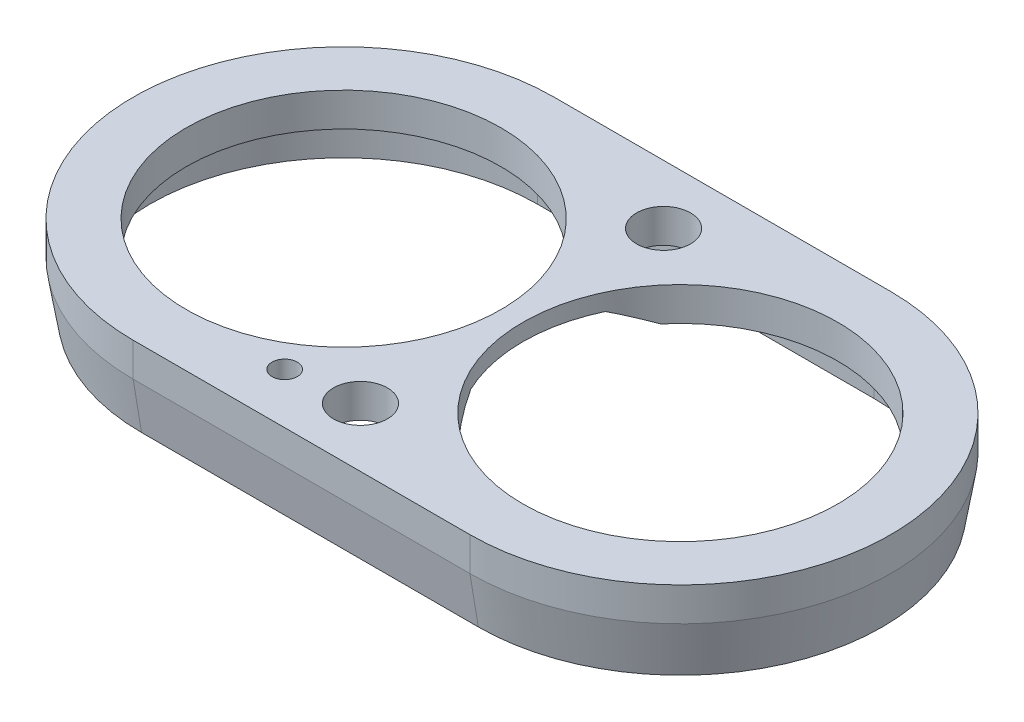
ISO-10303-21;
HEADER;
FILE_DESCRIPTION(('STEP AP214'),'2;1');
FILE_NAME('part.step','',(''),(''),'','','');
FILE_SCHEMA(('AUTOMOTIVE_DESIGN { 1 0 10303 214 1 1 1 1 }'));
ENDSEC;
DATA;
#1=APPLICATION_CONTEXT('core data for automotive mechanical design processes');
#2=APPLICATION_PROTOCOL_DEFINITION('international standard','automotive_design',2000,#1);
#3=PRODUCT_CONTEXT('',#1,'mechanical');
#4=PRODUCT('Part','Part','',(#3));
#5=PRODUCT_RELATED_PRODUCT_CATEGORY('part','',(#4));
#6=PRODUCT_DEFINITION_FORMATION('','',#4);
#7=PRODUCT_DEFINITION_CONTEXT('part definition',#1,'design');
#8=PRODUCT_DEFINITION('design','',#6,#7);
#9=PRODUCT_DEFINITION_SHAPE('','',#8);
#10=(LENGTH_UNIT() NAMED_UNIT(*) SI_UNIT(.MILLI.,.METRE.));
#11=(NAMED_UNIT(*) PLANE_ANGLE_UNIT() SI_UNIT($,.RADIAN.));
#12=(NAMED_UNIT(*) SI_UNIT($,.STERADIAN.) SOLID_ANGLE_UNIT());
#13=UNCERTAINTY_MEASURE_WITH_UNIT(LENGTH_MEASURE(1.E-05),#10,'distance_accuracy_value','');
#14=(GEOMETRIC_REPRESENTATION_CONTEXT(3) GLOBAL_UNCERTAINTY_ASSIGNED_CONTEXT((#13)) GLOBAL_UNIT_ASSIGNED_CONTEXT((#10,
#11,#12)) REPRESENTATION_CONTEXT('',''));
#15=CARTESIAN_POINT('',(0.,0.,0.));
#16=DIRECTION('',(0.,0.,1.));
#17=DIRECTION('',(1.,0.,0.));
#18=AXIS2_PLACEMENT_3D('',#15,#16,#17);
#19=CARTESIAN_POINT('',(10.,2.,0.));
#20=DIRECTION('',(0.,-1.,0.));
#21=DIRECTION('',(0.,0.,-1.));
#22=AXIS2_PLACEMENT_3D('',#19,#20,#21);
#23=CYLINDRICAL_SURFACE('',#22,12.5);
#24=DIRECTION('',(0.,-1.,0.));
#25=VECTOR('',#24,1.);
#26=CARTESIAN_POINT('',(10.,2.,12.5));
#27=LINE('',#26,#25);
#28=CARTESIAN_POINT('',(10.,2.,12.5));
#29=VERTEX_POINT('',#28);
#30=CARTESIAN_POINT('',(10.,0.,12.5));
#31=VERTEX_POINT('',#30);
#32=EDGE_CURVE('E305',#29,#31,#27,.T.);
#33=ORIENTED_EDGE('',*,*,#32,.T.);
#34=CARTESIAN_POINT('',(10.,0.,0.));
#35=DIRECTION('',(0.,-1.,0.));
#36=DIRECTION('',(0.,0.,-1.));
#37=AXIS2_PLACEMENT_3D('',#34,#35,#36);
#38=CIRCLE('',#37,12.5);
#39=CARTESIAN_POINT('',(10.,0.,-12.5));
#40=VERTEX_POINT('',#39);
#41=EDGE_CURVE('E325',#31,#40,#38,.F.);
#42=ORIENTED_EDGE('',*,*,#41,.T.);
#43=DIRECTION('',(0.,-1.,0.));
#44=VECTOR('',#43,1.);
#45=CARTESIAN_POINT('',(10.,2.,-12.5));
#46=LINE('',#45,#44);
#47=CARTESIAN_POINT('',(10.,2.,-12.5));
#48=VERTEX_POINT('',#47);
#49=EDGE_CURVE('E313',#48,#40,#46,.T.);
#50=ORIENTED_EDGE('',*,*,#49,.F.);
#51=CARTESIAN_POINT('',(10.,2.,0.));
#52=DIRECTION('',(0.,1.,0.));
#53=DIRECTION('',(0.,0.,1.));
#54=AXIS2_PLACEMENT_3D('',#51,#52,#53);
#55=CIRCLE('',#54,12.5);
#56=EDGE_CURVE('E158',#48,#29,#55,.F.);
#57=ORIENTED_EDGE('',*,*,#56,.T.);
#58=EDGE_LOOP('',(#33,#42,#50,#57));
#59=FACE_BOUND('',#58,.T.);
#60=ADVANCED_FACE('F38',(#59),#23,.T.);
#61=CARTESIAN_POINT('',(0.,2.,-12.5));
#62=DIRECTION('',(0.,0.,1.));
#63=DIRECTION('',(1.,0.,0.));
#64=AXIS2_PLACEMENT_3D('',#61,#62,#63);
#65=PLANE('',#64);
#66=ORIENTED_EDGE('',*,*,#49,.T.);
#67=DIRECTION('',(-1.,0.,0.));
#68=VECTOR('',#67,1.);
#69=CARTESIAN_POINT('',(-10.,0.,-12.5));
#70=LINE('',#69,#68);
#71=CARTESIAN_POINT('',(-10.,0.,-12.5));
#72=VERTEX_POINT('',#71);
#73=EDGE_CURVE('E328',#40,#72,#70,.T.);
#74=ORIENTED_EDGE('',*,*,#73,.T.);
#75=DIRECTION('',(0.,-1.,0.));
#76=VECTOR('',#75,1.);
#77=CARTESIAN_POINT('',(-10.,2.,-12.5));
#78=LINE('',#77,#76);
#79=CARTESIAN_POINT('',(-10.,2.,-12.5));
#80=VERTEX_POINT('',#79);
#81=EDGE_CURVE('E310',#80,#72,#78,.T.);
#82=ORIENTED_EDGE('',*,*,#81,.F.);
#83=DIRECTION('',(-1.,0.,0.));
#84=VECTOR('',#83,1.);
#85=CARTESIAN_POINT('',(0.,2.,-12.5));
#86=LINE('',#85,#84);
#87=EDGE_CURVE('E298',#48,#80,#86,.T.);
#88=ORIENTED_EDGE('',*,*,#87,.F.);
#89=EDGE_LOOP('',(#66,#74,#82,#88));
#90=FACE_BOUND('',#89,.T.);
#91=ADVANCED_FACE('F199',(#90),#65,.F.);
#92=CARTESIAN_POINT('',(-10.,2.,0.));
#93=DIRECTION('',(0.,-1.,0.));
#94=DIRECTION('',(0.,0.,-1.));
#95=AXIS2_PLACEMENT_3D('',#92,#93,#94);
#96=CYLINDRICAL_SURFACE('',#95,12.5);
#97=ORIENTED_EDGE('',*,*,#81,.T.);
#98=CARTESIAN_POINT('',(-10.,0.,0.));
#99=DIRECTION('',(0.,-1.,0.));
#100=DIRECTION('',(0.,0.,-1.));
#101=AXIS2_PLACEMENT_3D('',#98,#99,#100);
#102=CIRCLE('',#101,12.5);
#103=CARTESIAN_POINT('',(-10.,0.,12.5));
#104=VERTEX_POINT('',#103);
#105=EDGE_CURVE('E168',#72,#104,#102,.F.);
#106=ORIENTED_EDGE('',*,*,#105,.T.);
#107=DIRECTION('',(0.,-1.,0.));
#108=VECTOR('',#107,1.);
#109=CARTESIAN_POINT('',(-10.,2.,12.5));
#110=LINE('',#109,#108);
#111=CARTESIAN_POINT('',(-10.,2.,12.5));
#112=VERTEX_POINT('',#111);
#113=EDGE_CURVE('E307',#112,#104,#110,.T.);
#114=ORIENTED_EDGE('',*,*,#113,.F.);
#115=CARTESIAN_POINT('',(-10.,2.,0.));
#116=DIRECTION('',(0.,1.,0.));
#117=DIRECTION('',(0.,0.,1.));
#118=AXIS2_PLACEMENT_3D('',#115,#116,#117);
#119=CIRCLE('',#118,12.5);
#120=EDGE_CURVE('E300',#80,#112,#119,.T.);
#121=ORIENTED_EDGE('',*,*,#120,.F.);
#122=EDGE_LOOP('',(#97,#106,#114,#121));
#123=FACE_BOUND('',#122,.T.);
#124=ADVANCED_FACE('F205',(#123),#96,.T.);
#125=CARTESIAN_POINT('',(0.,2.,12.5));
#126=DIRECTION('',(0.,0.,1.));
#127=DIRECTION('',(1.,0.,0.));
#128=AXIS2_PLACEMENT_3D('',#125,#126,#127);
#129=PLANE('',#128);
#130=ORIENTED_EDGE('',*,*,#113,.T.);
#131=DIRECTION('',(1.,0.,0.));
#132=VECTOR('',#131,1.);
#133=CARTESIAN_POINT('',(0.,0.,12.5));
#134=LINE('',#133,#132);
#135=EDGE_CURVE('E330',#104,#31,#134,.T.);
#136=ORIENTED_EDGE('',*,*,#135,.T.);
#137=ORIENTED_EDGE('',*,*,#32,.F.);
#138=DIRECTION('',(-1.,0.,0.));
#139=VECTOR('',#138,1.);
#140=CARTESIAN_POINT('',(0.,2.,12.5));
#141=LINE('',#140,#139);
#142=EDGE_CURVE('E302',#29,#112,#141,.T.);
#143=ORIENTED_EDGE('',*,*,#142,.T.);
#144=EDGE_LOOP('',(#130,#136,#137,#143));
#145=FACE_BOUND('',#144,.T.);
#146=ADVANCED_FACE('F350',(#145),#129,.T.);
#147=CARTESIAN_POINT('',(0.,2.,0.));
#148=DIRECTION('',(0.,1.,0.));
#149=DIRECTION('',(0.,0.,1.));
#150=AXIS2_PLACEMENT_3D('',#147,#148,#149);
#151=PLANE('',#150);
#152=CARTESIAN_POINT('',(-4.,2.,9.5));
#153=DIRECTION('',(0.,1.,0.));
#154=DIRECTION('',(0.,0.,1.));
#155=AXIS2_PLACEMENT_3D('',#152,#153,#154);
#156=CIRCLE('',#155,0.75);
#157=CARTESIAN_POINT('',(-4.,2.,10.25));
#158=VERTEX_POINT('',#157);
#159=EDGE_CURVE('E178',#158,#158,#156,.T.);
#160=ORIENTED_EDGE('',*,*,#159,.F.);
#161=EDGE_LOOP('',(#160));
#162=FACE_BOUND('',#161,.T.);
#163=CARTESIAN_POINT('',(0.,2.,9.));
#164=DIRECTION('',(0.,1.,0.));
#165=DIRECTION('',(0.,0.,1.));
#166=AXIS2_PLACEMENT_3D('',#163,#164,#165);
#167=CIRCLE('',#166,1.6);
#168=CARTESIAN_POINT('',(0.,2.,10.6));
#169=VERTEX_POINT('',#168);
#170=EDGE_CURVE('E583',#169,#169,#167,.T.);
#171=ORIENTED_EDGE('',*,*,#170,.F.);
#172=EDGE_LOOP('',(#171));
#173=FACE_BOUND('',#172,.T.);
#174=CARTESIAN_POINT('',(0.,2.,-9.));
#175=DIRECTION('',(0.,1.,0.));
#176=DIRECTION('',(0.,0.,1.));
#177=AXIS2_PLACEMENT_3D('',#174,#175,#176);
#178=CIRCLE('',#177,1.6);
#179=CARTESIAN_POINT('',(0.,2.,-7.4));
#180=VERTEX_POINT('',#179);
#181=EDGE_CURVE('E579',#180,#180,#178,.T.);
#182=ORIENTED_EDGE('',*,*,#181,.F.);
#183=EDGE_LOOP('',(#182));
#184=FACE_BOUND('',#183,.T.);
#185=CARTESIAN_POINT('',(10.,2.,0.));
#186=DIRECTION('',(0.,1.,0.));
#187=DIRECTION('',(0.,0.,1.));
#188=AXIS2_PLACEMENT_3D('',#185,#186,#187);
#189=CIRCLE('',#188,9.35);
#190=CARTESIAN_POINT('',(10.,2.,9.35));
#191=VERTEX_POINT('',#190);
#192=EDGE_CURVE('E159',#191,#191,#189,.T.);
#193=ORIENTED_EDGE('',*,*,#192,.F.);
#194=EDGE_LOOP('',(#193));
#195=FACE_BOUND('',#194,.T.);
#196=CARTESIAN_POINT('',(-10.,2.,0.));
#197=DIRECTION('',(0.,1.,0.));
#198=DIRECTION('',(0.,0.,-1.));
#199=AXIS2_PLACEMENT_3D('',#196,#197,#198);
#200=CIRCLE('',#199,9.35);
#201=CARTESIAN_POINT('',(-10.,2.,-9.35));
#202=VERTEX_POINT('',#201);
#203=EDGE_CURVE('E292',#202,#202,#200,.T.);
#204=ORIENTED_EDGE('',*,*,#203,.F.);
#205=EDGE_LOOP('',(#204));
#206=FACE_BOUND('',#205,.T.);
#207=ORIENTED_EDGE('',*,*,#56,.F.);
#208=ORIENTED_EDGE('',*,*,#87,.T.);
#209=ORIENTED_EDGE('',*,*,#120,.T.);
#210=ORIENTED_EDGE('',*,*,#142,.F.);
#211=EDGE_LOOP('',(#207,#208,#209,#210));
#212=FACE_BOUND('',#211,.T.);
#213=ADVANCED_FACE('F354',(#162,#173,#184,#195,#206,#212),#151,.T.);
#214=CARTESIAN_POINT('',(0.,0.,0.));
#215=DIRECTION('',(0.,1.,0.));
#216=DIRECTION('',(0.,0.,1.));
#217=AXIS2_PLACEMENT_3D('',#214,#215,#216);
#218=PLANE('',#217);
#219=CARTESIAN_POINT('',(-4.,0.,9.5));
#220=DIRECTION('',(0.,1.,0.));
#221=DIRECTION('',(0.,0.,1.));
#222=AXIS2_PLACEMENT_3D('',#219,#220,#221);
#223=CIRCLE('',#222,0.75);
#224=CARTESIAN_POINT('',(-4.,0.,10.25));
#225=VERTEX_POINT('',#224);
#226=EDGE_CURVE('E43',#225,#225,#223,.T.);
#227=ORIENTED_EDGE('',*,*,#226,.T.);
#228=EDGE_LOOP('',(#227));
#229=FACE_BOUND('',#228,.T.);
#230=CARTESIAN_POINT('',(0.,0.,9.));
#231=DIRECTION('',(0.,1.,0.));
#232=DIRECTION('',(0.,0.,1.));
#233=AXIS2_PLACEMENT_3D('',#230,#231,#232);
#234=CIRCLE('',#233,1.6);
#235=CARTESIAN_POINT('',(0.,0.,10.6));
#236=VERTEX_POINT('',#235);
#237=EDGE_CURVE('E177',#236,#236,#234,.T.);
#238=ORIENTED_EDGE('',*,*,#237,.T.);
#239=EDGE_LOOP('',(#238));
#240=FACE_BOUND('',#239,.T.);
#241=CARTESIAN_POINT('',(0.,0.,-9.));
#242=DIRECTION('',(0.,1.,0.));
#243=DIRECTION('',(0.,0.,1.));
#244=AXIS2_PLACEMENT_3D('',#241,#242,#243);
#245=CIRCLE('',#244,1.6);
#246=CARTESIAN_POINT('',(0.,0.,-7.4));
#247=VERTEX_POINT('',#246);
#248=EDGE_CURVE('E175',#247,#247,#245,.T.);
#249=ORIENTED_EDGE('',*,*,#248,.T.);
#250=EDGE_LOOP('',(#249));
#251=FACE_BOUND('',#250,.T.);
#252=DIRECTION('',(-1.,0.,0.));
#253=VECTOR('',#252,1.);
#254=CARTESIAN_POINT('',(10.,0.,11.5));
#255=LINE('',#254,#253);
#256=CARTESIAN_POINT('',(10.,0.,11.5));
#257=VERTEX_POINT('',#256);
#258=CARTESIAN_POINT('',(-10.,0.,11.5));
#259=VERTEX_POINT('',#258);
#260=EDGE_CURVE('E262',#257,#259,#255,.T.);
#261=ORIENTED_EDGE('',*,*,#260,.T.);
#262=CARTESIAN_POINT('',(-10.,0.,0.));
#263=DIRECTION('',(0.,-1.,0.));
#264=DIRECTION('',(0.,0.,-1.));
#265=AXIS2_PLACEMENT_3D('',#262,#263,#264);
#266=CIRCLE('',#265,11.5);
#267=CARTESIAN_POINT('',(-10.,0.,-11.5));
#268=VERTEX_POINT('',#267);
#269=EDGE_CURVE('E270',#259,#268,#266,.T.);
#270=ORIENTED_EDGE('',*,*,#269,.T.);
#271=DIRECTION('',(1.,0.,0.));
#272=VECTOR('',#271,1.);
#273=CARTESIAN_POINT('',(-10.,0.,-11.5));
#274=LINE('',#273,#272);
#275=CARTESIAN_POINT('',(10.,0.,-11.5));
#276=VERTEX_POINT('',#275);
#277=EDGE_CURVE('E273',#268,#276,#274,.T.);
#278=ORIENTED_EDGE('',*,*,#277,.T.);
#279=CARTESIAN_POINT('',(10.,0.,0.));
#280=DIRECTION('',(0.,-1.,0.));
#281=DIRECTION('',(0.,0.,-1.));
#282=AXIS2_PLACEMENT_3D('',#279,#280,#281);
#283=CIRCLE('',#282,11.5);
#284=EDGE_CURVE('E277',#276,#257,#283,.T.);
#285=ORIENTED_EDGE('',*,*,#284,.T.);
#286=EDGE_LOOP('',(#261,#270,#278,#285));
#287=FACE_BOUND('',#286,.T.);
#288=CARTESIAN_POINT('',(10.,0.,0.));
#289=DIRECTION('',(0.,1.,0.));
#290=DIRECTION('',(0.,0.,1.));
#291=AXIS2_PLACEMENT_3D('',#288,#289,#290);
#292=CIRCLE('',#291,9.35);
#293=CARTESIAN_POINT('',(2.82905166662038,0.,6.));
#294=VERTEX_POINT('',#293);
#295=CARTESIAN_POINT('',(2.82905166662038,0.,-6.));
#296=VERTEX_POINT('',#295);
#297=EDGE_CURVE('E146',#294,#296,#292,.T.);
#298=ORIENTED_EDGE('',*,*,#297,.T.);
#299=DIRECTION('',(1.,0.,0.));
#300=VECTOR('',#299,1.);
#301=CARTESIAN_POINT('',(-7.5,0.,-6.));
#302=LINE('',#301,#300);
#303=CARTESIAN_POINT('',(-2.82905166662038,0.,-6.));
#304=VERTEX_POINT('',#303);
#305=EDGE_CURVE('E150',#304,#296,#302,.T.);
#306=ORIENTED_EDGE('',*,*,#305,.F.);
#307=CARTESIAN_POINT('',(-10.,0.,0.));
#308=DIRECTION('',(0.,1.,0.));
#309=DIRECTION('',(0.,0.,-1.));
#310=AXIS2_PLACEMENT_3D('',#307,#308,#309);
#311=CIRCLE('',#310,9.35);
#312=CARTESIAN_POINT('',(-2.82905166662038,0.,6.));
#313=VERTEX_POINT('',#312);
#314=EDGE_CURVE('E148',#304,#313,#311,.T.);
#315=ORIENTED_EDGE('',*,*,#314,.T.);
#316=DIRECTION('',(-1.,0.,0.));
#317=VECTOR('',#316,1.);
#318=CARTESIAN_POINT('',(-7.5,0.,6.));
#319=LINE('',#318,#317);
#320=EDGE_CURVE('E143',#294,#313,#319,.T.);
#321=ORIENTED_EDGE('',*,*,#320,.F.);
#322=EDGE_LOOP('',(#298,#306,#315,#321));
#323=FACE_BOUND('',#322,.T.);
#324=ADVANCED_FACE('F145',(#229,#240,#251,#287,#323),#218,.F.);
#325=CARTESIAN_POINT('',(-10.,0.,0.));
#326=DIRECTION('',(0.,1.,0.));
#327=DIRECTION('',(0.,0.,1.));
#328=AXIS2_PLACEMENT_3D('',#325,#326,#327);
#329=CYLINDRICAL_SURFACE('',#328,9.35);
#330=ORIENTED_EDGE('',*,*,#314,.F.);
#331=CARTESIAN_POINT('',(-10.,3.00000000000002,0.));
#332=DIRECTION('',(0.,-0.894427190999915,0.44721359549996));
#333=DIRECTION('',(0.,0.44721359549996,0.894427190999915));
#334=AXIS2_PLACEMENT_3D('',#331,#332,#333);
#335=ELLIPSE('',#334,10.4536177948115,9.35);
#336=CARTESIAN_POINT('',(-1.54881665090622,1.,-4.00000000000001));
#337=VERTEX_POINT('',#336);
#338=EDGE_CURVE('E63',#304,#337,#335,.T.);
#339=ORIENTED_EDGE('',*,*,#338,.T.);
#340=CARTESIAN_POINT('',(-10.,1.,0.));
#341=DIRECTION('',(0.,1.,0.));
#342=DIRECTION('',(0.,0.,1.));
#343=AXIS2_PLACEMENT_3D('',#340,#341,#342);
#344=CIRCLE('',#343,9.35);
#345=CARTESIAN_POINT('',(-1.54881665090622,1.,4.00000000000001));
#346=VERTEX_POINT('',#345);
#347=EDGE_CURVE('E252',#337,#346,#344,.F.);
#348=ORIENTED_EDGE('',*,*,#347,.T.);
#349=CARTESIAN_POINT('',(-10.,3.00000000000002,0.));
#350=DIRECTION('',(0.,-0.894427190999915,-0.44721359549996));
#351=DIRECTION('',(0.,0.44721359549996,-0.894427190999915));
#352=AXIS2_PLACEMENT_3D('',#349,#350,#351);
#353=ELLIPSE('',#352,10.4536177948115,9.35);
#354=EDGE_CURVE('E48',#346,#313,#353,.T.);
#355=ORIENTED_EDGE('',*,*,#354,.T.);
#356=EDGE_LOOP('',(#330,#339,#348,#355));
#357=FACE_BOUND('',#356,.T.);
#358=ORIENTED_EDGE('',*,*,#203,.T.);
#359=EDGE_LOOP('',(#358));
#360=FACE_BOUND('',#359,.T.);
#361=ADVANCED_FACE('F397',(#357,#360),#329,.F.);
#362=CARTESIAN_POINT('',(10.,0.,0.));
#363=DIRECTION('',(0.,1.,0.));
#364=DIRECTION('',(0.,0.,1.));
#365=AXIS2_PLACEMENT_3D('',#362,#363,#364);
#366=CYLINDRICAL_SURFACE('',#365,9.35);
#367=ORIENTED_EDGE('',*,*,#297,.F.);
#368=CARTESIAN_POINT('',(10.,3.00000000000002,0.));
#369=DIRECTION('',(0.,-0.894427190999915,-0.44721359549996));
#370=DIRECTION('',(0.,0.44721359549996,-0.894427190999915));
#371=AXIS2_PLACEMENT_3D('',#368,#369,#370);
#372=ELLIPSE('',#371,10.4536177948115,9.35);
#373=CARTESIAN_POINT('',(1.54881665090622,1.,4.00000000000001));
#374=VERTEX_POINT('',#373);
#375=EDGE_CURVE('E11',#294,#374,#372,.T.);
#376=ORIENTED_EDGE('',*,*,#375,.T.);
#377=CARTESIAN_POINT('',(10.,1.,0.));
#378=DIRECTION('',(0.,1.,0.));
#379=DIRECTION('',(0.,0.,1.));
#380=AXIS2_PLACEMENT_3D('',#377,#378,#379);
#381=CIRCLE('',#380,9.35);
#382=CARTESIAN_POINT('',(1.54881665090622,1.,-4.00000000000001));
#383=VERTEX_POINT('',#382);
#384=EDGE_CURVE('E164',#374,#383,#381,.F.);
#385=ORIENTED_EDGE('',*,*,#384,.T.);
#386=CARTESIAN_POINT('',(10.,3.00000000000002,0.));
#387=DIRECTION('',(0.,-0.894427190999915,0.44721359549996));
#388=DIRECTION('',(0.,0.44721359549996,0.894427190999915));
#389=AXIS2_PLACEMENT_3D('',#386,#387,#388);
#390=ELLIPSE('',#389,10.4536177948115,9.35);
#391=EDGE_CURVE('E157',#383,#296,#390,.T.);
#392=ORIENTED_EDGE('',*,*,#391,.T.);
#393=EDGE_LOOP('',(#367,#376,#385,#392));
#394=FACE_BOUND('',#393,.T.);
#395=ORIENTED_EDGE('',*,*,#192,.T.);
#396=EDGE_LOOP('',(#395));
#397=FACE_BOUND('',#396,.T.);
#398=ADVANCED_FACE('F153',(#394,#397),#366,.F.);
#399=CARTESIAN_POINT('',(10.,-3.,0.));
#400=DIRECTION('',(0.,-1.,0.));
#401=DIRECTION('',(0.,0.,-1.));
#402=AXIS2_PLACEMENT_3D('',#399,#400,#401);
#403=PLANE('',#402);
#404=DIRECTION('',(1.,0.,0.));
#405=VECTOR('',#404,1.);
#406=CARTESIAN_POINT('',(10.,-3.,-12.));
#407=LINE('',#406,#405);
#408=CARTESIAN_POINT('',(-10.,-3.,-12.));
#409=VERTEX_POINT('',#408);
#410=CARTESIAN_POINT('',(10.,-3.,-12.));
#411=VERTEX_POINT('',#410);
#412=EDGE_CURVE('E320',#409,#411,#407,.T.);
#413=ORIENTED_EDGE('',*,*,#412,.T.);
#414=CARTESIAN_POINT('',(10.,-3.,0.));
#415=DIRECTION('',(0.,-1.,0.));
#416=DIRECTION('',(0.,0.,-1.));
#417=AXIS2_PLACEMENT_3D('',#414,#415,#416);
#418=CIRCLE('',#417,12.);
#419=CARTESIAN_POINT('',(10.,-3.,12.));
#420=VERTEX_POINT('',#419);
#421=EDGE_CURVE('E322',#411,#420,#418,.T.);
#422=ORIENTED_EDGE('',*,*,#421,.T.);
#423=DIRECTION('',(-1.,0.,0.));
#424=VECTOR('',#423,1.);
#425=CARTESIAN_POINT('',(10.,-3.,12.));
#426=LINE('',#425,#424);
#427=CARTESIAN_POINT('',(-10.,-3.,12.));
#428=VERTEX_POINT('',#427);
#429=EDGE_CURVE('E318',#420,#428,#426,.T.);
#430=ORIENTED_EDGE('',*,*,#429,.T.);
#431=CARTESIAN_POINT('',(-10.,-3.,0.));
#432=DIRECTION('',(0.,-1.,0.));
#433=DIRECTION('',(0.,0.,-1.));
#434=AXIS2_PLACEMENT_3D('',#431,#432,#433);
#435=CIRCLE('',#434,12.);
#436=EDGE_CURVE('E316',#428,#409,#435,.T.);
#437=ORIENTED_EDGE('',*,*,#436,.T.);
#438=EDGE_LOOP('',(#413,#422,#430,#437));
#439=FACE_BOUND('',#438,.T.);
#440=DIRECTION('',(1.,0.,0.));
#441=VECTOR('',#440,1.);
#442=CARTESIAN_POINT('',(-10.,-3.,-11.5));
#443=LINE('',#442,#441);
#444=CARTESIAN_POINT('',(-10.,-3.,-11.5));
#445=VERTEX_POINT('',#444);
#446=CARTESIAN_POINT('',(10.,-3.,-11.5));
#447=VERTEX_POINT('',#446);
#448=EDGE_CURVE('E261',#445,#447,#443,.T.);
#449=ORIENTED_EDGE('',*,*,#448,.F.);
#450=CARTESIAN_POINT('',(-10.,-3.,0.));
#451=DIRECTION('',(0.,-1.,0.));
#452=DIRECTION('',(0.,0.,-1.));
#453=AXIS2_PLACEMENT_3D('',#450,#451,#452);
#454=CIRCLE('',#453,11.5);
#455=CARTESIAN_POINT('',(-10.,-3.,11.5));
#456=VERTEX_POINT('',#455);
#457=EDGE_CURVE('E259',#456,#445,#454,.T.);
#458=ORIENTED_EDGE('',*,*,#457,.F.);
#459=DIRECTION('',(-1.,0.,0.));
#460=VECTOR('',#459,1.);
#461=CARTESIAN_POINT('',(10.,-3.,11.5));
#462=LINE('',#461,#460);
#463=CARTESIAN_POINT('',(10.,-3.,11.5));
#464=VERTEX_POINT('',#463);
#465=EDGE_CURVE('E267',#464,#456,#462,.T.);
#466=ORIENTED_EDGE('',*,*,#465,.F.);
#467=CARTESIAN_POINT('',(10.,-3.,0.));
#468=DIRECTION('',(0.,-1.,0.));
#469=DIRECTION('',(0.,0.,-1.));
#470=AXIS2_PLACEMENT_3D('',#467,#468,#469);
#471=CIRCLE('',#470,11.5);
#472=EDGE_CURVE('E264',#447,#464,#471,.T.);
#473=ORIENTED_EDGE('',*,*,#472,.F.);
#474=EDGE_LOOP('',(#449,#458,#466,#473));
#475=FACE_BOUND('',#474,.T.);
#476=ADVANCED_FACE('F361',(#439,#475),#403,.T.);
#477=CARTESIAN_POINT('',(-10.,-3.,0.));
#478=DIRECTION('',(0.,1.,0.));
#479=DIRECTION('',(0.,0.,1.));
#480=AXIS2_PLACEMENT_3D('',#477,#478,#479);
#481=CYLINDRICAL_SURFACE('',#480,11.5);
#482=ORIENTED_EDGE('',*,*,#269,.F.);
#483=DIRECTION('',(0.,1.,0.));
#484=VECTOR('',#483,1.);
#485=CARTESIAN_POINT('',(-10.,-3.,11.5));
#486=LINE('',#485,#484);
#487=EDGE_CURVE('E269',#456,#259,#486,.T.);
#488=ORIENTED_EDGE('',*,*,#487,.F.);
#489=ORIENTED_EDGE('',*,*,#457,.T.);
#490=DIRECTION('',(0.,1.,0.));
#491=VECTOR('',#490,1.);
#492=CARTESIAN_POINT('',(-10.,-3.,-11.5));
#493=LINE('',#492,#491);
#494=EDGE_CURVE('E287',#445,#268,#493,.T.);
#495=ORIENTED_EDGE('',*,*,#494,.T.);
#496=EDGE_LOOP('',(#482,#488,#489,#495));
#497=FACE_BOUND('',#496,.T.);
#498=ADVANCED_FACE('F364',(#497),#481,.F.);
#499=CARTESIAN_POINT('',(-10.,-3.,-11.5));
#500=DIRECTION('',(0.,0.,1.));
#501=DIRECTION('',(1.,0.,0.));
#502=AXIS2_PLACEMENT_3D('',#499,#500,#501);
#503=PLANE('',#502);
#504=ORIENTED_EDGE('',*,*,#277,.F.);
#505=ORIENTED_EDGE('',*,*,#494,.F.);
#506=ORIENTED_EDGE('',*,*,#448,.T.);
#507=DIRECTION('',(0.,1.,0.));
#508=VECTOR('',#507,1.);
#509=CARTESIAN_POINT('',(10.,-3.,-11.5));
#510=LINE('',#509,#508);
#511=EDGE_CURVE('E285',#447,#276,#510,.T.);
#512=ORIENTED_EDGE('',*,*,#511,.T.);
#513=EDGE_LOOP('',(#504,#505,#506,#512));
#514=FACE_BOUND('',#513,.T.);
#515=ADVANCED_FACE('F373',(#514),#503,.T.);
#516=CARTESIAN_POINT('',(10.,-3.,0.));
#517=DIRECTION('',(0.,1.,0.));
#518=DIRECTION('',(0.,0.,1.));
#519=AXIS2_PLACEMENT_3D('',#516,#517,#518);
#520=CYLINDRICAL_SURFACE('',#519,11.5);
#521=ORIENTED_EDGE('',*,*,#284,.F.);
#522=ORIENTED_EDGE('',*,*,#511,.F.);
#523=ORIENTED_EDGE('',*,*,#472,.T.);
#524=DIRECTION('',(0.,1.,0.));
#525=VECTOR('',#524,1.);
#526=CARTESIAN_POINT('',(10.,-3.,11.5));
#527=LINE('',#526,#525);
#528=EDGE_CURVE('E283',#464,#257,#527,.T.);
#529=ORIENTED_EDGE('',*,*,#528,.T.);
#530=EDGE_LOOP('',(#521,#522,#523,#529));
#531=FACE_BOUND('',#530,.T.);
#532=ADVANCED_FACE('F376',(#531),#520,.F.);
#533=CARTESIAN_POINT('',(10.,-3.,11.5));
#534=DIRECTION('',(0.,0.,-1.));
#535=DIRECTION('',(-1.,0.,0.));
#536=AXIS2_PLACEMENT_3D('',#533,#534,#535);
#537=PLANE('',#536);
#538=ORIENTED_EDGE('',*,*,#260,.F.);
#539=ORIENTED_EDGE('',*,*,#528,.F.);
#540=ORIENTED_EDGE('',*,*,#465,.T.);
#541=ORIENTED_EDGE('',*,*,#487,.T.);
#542=EDGE_LOOP('',(#538,#539,#540,#541));
#543=FACE_BOUND('',#542,.T.);
#544=ADVANCED_FACE('F239',(#543),#537,.T.);
#545=CARTESIAN_POINT('',(-10.,-3.,0.));
#546=DIRECTION('',(0.,1.,0.));
#547=DIRECTION('',(0.,0.,1.));
#548=AXIS2_PLACEMENT_3D('',#545,#546,#547);
#549=CONICAL_SURFACE('',#548,12.,0.165148677414623);
#550=DIRECTION('',(0.,-0.986393923832144,-0.164398987305354));
#551=VECTOR('',#550,1.);
#552=CARTESIAN_POINT('',(-10.,0.,12.5));
#553=LINE('',#552,#551);
#554=EDGE_CURVE('E334',#104,#428,#553,.T.);
#555=ORIENTED_EDGE('',*,*,#554,.F.);
#556=ORIENTED_EDGE('',*,*,#105,.F.);
#557=DIRECTION('',(0.,0.986393923832144,-0.164398987305354));
#558=VECTOR('',#557,1.);
#559=CARTESIAN_POINT('',(-10.,-3.,-12.));
#560=LINE('',#559,#558);
#561=EDGE_CURVE('E274',#409,#72,#560,.T.);
#562=ORIENTED_EDGE('',*,*,#561,.F.);
#563=ORIENTED_EDGE('',*,*,#436,.F.);
#564=EDGE_LOOP('',(#555,#556,#562,#563));
#565=FACE_BOUND('',#564,.T.);
#566=ADVANCED_FACE('F234',(#565),#549,.T.);
#567=CARTESIAN_POINT('',(10.,-3.,-12.));
#568=DIRECTION('',(0.,-0.164398987305354,-0.986393923832144));
#569=DIRECTION('',(-1.,0.,0.));
#570=AXIS2_PLACEMENT_3D('',#567,#568,#569);
#571=PLANE('',#570);
#572=ORIENTED_EDGE('',*,*,#561,.T.);
#573=ORIENTED_EDGE('',*,*,#73,.F.);
#574=DIRECTION('',(0.,0.986393923832144,-0.164398987305354));
#575=VECTOR('',#574,1.);
#576=CARTESIAN_POINT('',(10.,-3.,-12.));
#577=LINE('',#576,#575);
#578=EDGE_CURVE('E255',#411,#40,#577,.T.);
#579=ORIENTED_EDGE('',*,*,#578,.F.);
#580=ORIENTED_EDGE('',*,*,#412,.F.);
#581=EDGE_LOOP('',(#572,#573,#579,#580));
#582=FACE_BOUND('',#581,.T.);
#583=ADVANCED_FACE('F227',(#582),#571,.T.);
#584=CARTESIAN_POINT('',(10.,-3.,12.));
#585=DIRECTION('',(0.,0.164398987305354,-0.986393923832144));
#586=DIRECTION('',(-1.,0.,0.));
#587=AXIS2_PLACEMENT_3D('',#584,#585,#586);
#588=PLANE('',#587);
#589=ORIENTED_EDGE('',*,*,#554,.T.);
#590=ORIENTED_EDGE('',*,*,#429,.F.);
#591=DIRECTION('',(0.,-0.986393923832144,-0.164398987305354));
#592=VECTOR('',#591,1.);
#593=CARTESIAN_POINT('',(10.,0.,12.5));
#594=LINE('',#593,#592);
#595=EDGE_CURVE('E253',#31,#420,#594,.T.);
#596=ORIENTED_EDGE('',*,*,#595,.F.);
#597=ORIENTED_EDGE('',*,*,#135,.F.);
#598=EDGE_LOOP('',(#589,#590,#596,#597));
#599=FACE_BOUND('',#598,.T.);
#600=ADVANCED_FACE('F220',(#599),#588,.F.);
#601=CARTESIAN_POINT('',(10.,-3.,0.));
#602=DIRECTION('',(0.,1.,0.));
#603=DIRECTION('',(0.,0.,1.));
#604=AXIS2_PLACEMENT_3D('',#601,#602,#603);
#605=CONICAL_SURFACE('',#604,12.,0.165148677414623);
#606=ORIENTED_EDGE('',*,*,#578,.T.);
#607=ORIENTED_EDGE('',*,*,#41,.F.);
#608=ORIENTED_EDGE('',*,*,#595,.T.);
#609=ORIENTED_EDGE('',*,*,#421,.F.);
#610=EDGE_LOOP('',(#606,#607,#608,#609));
#611=FACE_BOUND('',#610,.T.);
#612=ADVANCED_FACE('F212',(#611),#605,.T.);
#613=CARTESIAN_POINT('',(0.,1.,0.));
#614=DIRECTION('',(0.,1.,0.));
#615=DIRECTION('',(0.,0.,1.));
#616=AXIS2_PLACEMENT_3D('',#613,#614,#615);
#617=PLANE('',#616);
#618=ORIENTED_EDGE('',*,*,#347,.F.);
#619=DIRECTION('',(1.,0.,0.));
#620=VECTOR('',#619,1.);
#621=CARTESIAN_POINT('',(2.82905166662038,1.,-4.00000000000001));
#622=LINE('',#621,#620);
#623=EDGE_CURVE('E163',#337,#383,#622,.T.);
#624=ORIENTED_EDGE('',*,*,#623,.T.);
#625=ORIENTED_EDGE('',*,*,#384,.F.);
#626=DIRECTION('',(-1.,0.,0.));
#627=VECTOR('',#626,1.);
#628=CARTESIAN_POINT('',(-2.82905166662038,1.,4.00000000000001));
#629=LINE('',#628,#627);
#630=EDGE_CURVE('E161',#374,#346,#629,.T.);
#631=ORIENTED_EDGE('',*,*,#630,.T.);
#632=EDGE_LOOP('',(#618,#624,#625,#631));
#633=FACE_BOUND('',#632,.T.);
#634=ADVANCED_FACE('F219',(#633),#617,.F.);
#635=CARTESIAN_POINT('',(0.,1.,-4.00000000000001));
#636=DIRECTION('',(0.,-0.894427190999915,0.44721359549996));
#637=DIRECTION('',(-1.,0.,0.));
#638=AXIS2_PLACEMENT_3D('',#635,#636,#637);
#639=PLANE('',#638);
#640=ORIENTED_EDGE('',*,*,#338,.F.);
#641=ORIENTED_EDGE('',*,*,#305,.T.);
#642=ORIENTED_EDGE('',*,*,#391,.F.);
#643=ORIENTED_EDGE('',*,*,#623,.F.);
#644=EDGE_LOOP('',(#640,#641,#642,#643));
#645=FACE_BOUND('',#644,.T.);
#646=ADVANCED_FACE('F241',(#645),#639,.T.);
#647=CARTESIAN_POINT('',(0.,1.,4.00000000000001));
#648=DIRECTION('',(0.,-0.894427190999915,-0.44721359549996));
#649=DIRECTION('',(1.,0.,0.));
#650=AXIS2_PLACEMENT_3D('',#647,#648,#649);
#651=PLANE('',#650);
#652=ORIENTED_EDGE('',*,*,#375,.F.);
#653=ORIENTED_EDGE('',*,*,#320,.T.);
#654=ORIENTED_EDGE('',*,*,#354,.F.);
#655=ORIENTED_EDGE('',*,*,#630,.F.);
#656=EDGE_LOOP('',(#652,#653,#654,#655));
#657=FACE_BOUND('',#656,.T.);
#658=ADVANCED_FACE('F41',(#657),#651,.T.);
#659=CARTESIAN_POINT('',(0.,-3.,-9.));
#660=DIRECTION('',(0.,1.,0.));
#661=DIRECTION('',(0.,0.,1.));
#662=AXIS2_PLACEMENT_3D('',#659,#660,#661);
#663=CYLINDRICAL_SURFACE('',#662,1.6);
#664=ORIENTED_EDGE('',*,*,#181,.T.);
#665=EDGE_LOOP('',(#664));
#666=FACE_BOUND('',#665,.T.);
#667=ORIENTED_EDGE('',*,*,#248,.F.);
#668=EDGE_LOOP('',(#667));
#669=FACE_BOUND('',#668,.T.);
#670=ADVANCED_FACE('F194',(#666,#669),#663,.F.);
#671=CARTESIAN_POINT('',(0.,-3.,9.));
#672=DIRECTION('',(0.,1.,0.));
#673=DIRECTION('',(0.,0.,1.));
#674=AXIS2_PLACEMENT_3D('',#671,#672,#673);
#675=CYLINDRICAL_SURFACE('',#674,1.6);
#676=ORIENTED_EDGE('',*,*,#170,.T.);
#677=EDGE_LOOP('',(#676));
#678=FACE_BOUND('',#677,.T.);
#679=ORIENTED_EDGE('',*,*,#237,.F.);
#680=EDGE_LOOP('',(#679));
#681=FACE_BOUND('',#680,.T.);
#682=ADVANCED_FACE('F188',(#678,#681),#675,.F.);
#683=CARTESIAN_POINT('',(-4.,-3.,9.5));
#684=DIRECTION('',(0.,1.,0.));
#685=DIRECTION('',(0.,0.,1.));
#686=AXIS2_PLACEMENT_3D('',#683,#684,#685);
#687=CYLINDRICAL_SURFACE('',#686,0.75);
#688=ORIENTED_EDGE('',*,*,#159,.T.);
#689=EDGE_LOOP('',(#688));
#690=FACE_BOUND('',#689,.T.);
#691=ORIENTED_EDGE('',*,*,#226,.F.);
#692=EDGE_LOOP('',(#691));
#693=FACE_BOUND('',#692,.T.);
#694=ADVANCED_FACE('F186',(#690,#693),#687,.F.);
#695=CLOSED_SHELL('',(#60,#91,#124,#146,#213,#324,#361,#398,#476,#498,#515,#532,#544,#566,#583,
#600,#612,#634,#646,#658,#670,#682,#694));
#696=MANIFOLD_SOLID_BREP('B2',#695);
#697=ADVANCED_BREP_SHAPE_REPRESENTATION('',(#18,#696),#14);
#698=SHAPE_DEFINITION_REPRESENTATION(#9,#697);
ENDSEC;
END-ISO-10303-21;
